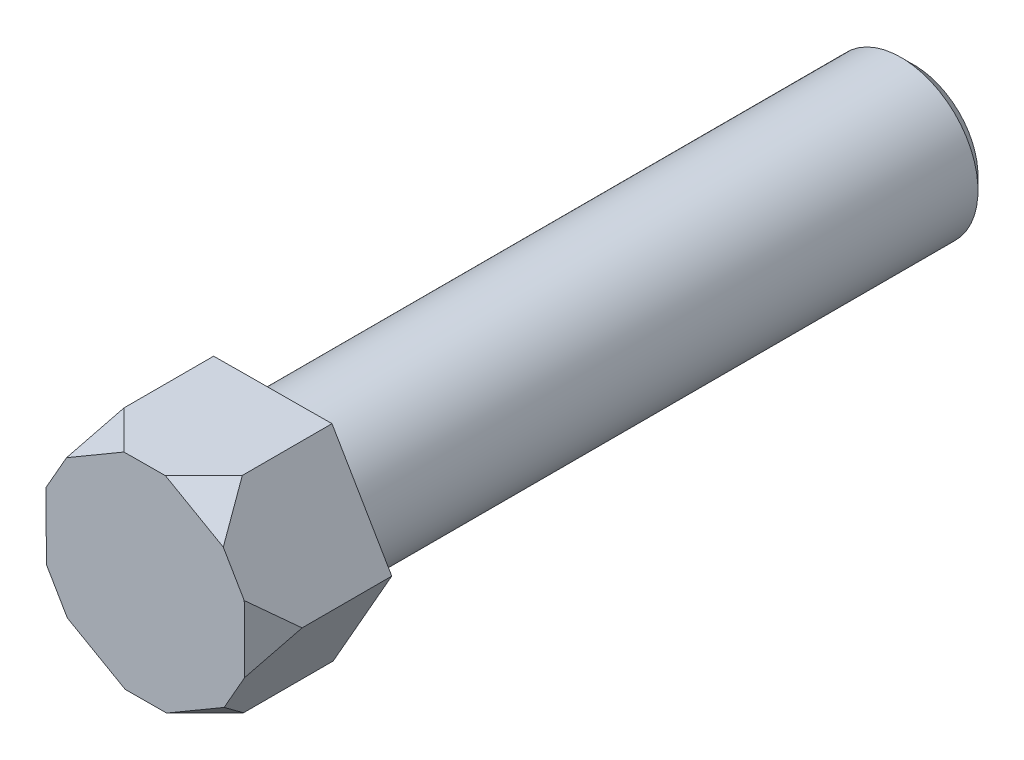
ISO-10303-21;
HEADER;
FILE_DESCRIPTION(('STEP AP214'),'2;1');
FILE_NAME('part.step','',(''),(''),'','','');
FILE_SCHEMA(('AUTOMOTIVE_DESIGN { 1 0 10303 214 1 1 1 1 }'));
ENDSEC;
DATA;
#1=APPLICATION_CONTEXT('core data for automotive mechanical design processes');
#2=APPLICATION_PROTOCOL_DEFINITION('international standard','automotive_design',2000,#1);
#3=PRODUCT_CONTEXT('',#1,'mechanical');
#4=PRODUCT('Part','Part','',(#3));
#5=PRODUCT_RELATED_PRODUCT_CATEGORY('part','',(#4));
#6=PRODUCT_DEFINITION_FORMATION('','',#4);
#7=PRODUCT_DEFINITION_CONTEXT('part definition',#1,'design');
#8=PRODUCT_DEFINITION('design','',#6,#7);
#9=PRODUCT_DEFINITION_SHAPE('','',#8);
#10=(LENGTH_UNIT() NAMED_UNIT(*) SI_UNIT(.MILLI.,.METRE.));
#11=(NAMED_UNIT(*) PLANE_ANGLE_UNIT() SI_UNIT($,.RADIAN.));
#12=(NAMED_UNIT(*) SI_UNIT($,.STERADIAN.) SOLID_ANGLE_UNIT());
#13=UNCERTAINTY_MEASURE_WITH_UNIT(LENGTH_MEASURE(1.E-05),#10,'distance_accuracy_value','');
#14=(GEOMETRIC_REPRESENTATION_CONTEXT(3) GLOBAL_UNCERTAINTY_ASSIGNED_CONTEXT((#13)) GLOBAL_UNIT_ASSIGNED_CONTEXT((#10,
#11,#12)) REPRESENTATION_CONTEXT('',''));
#15=CARTESIAN_POINT('',(0.,0.,0.));
#16=DIRECTION('',(0.,0.,1.));
#17=DIRECTION('',(1.,0.,0.));
#18=AXIS2_PLACEMENT_3D('',#15,#16,#17);
#19=CARTESIAN_POINT('',(-2.2857515646105,-4.01356115167241,-5.));
#20=DIRECTION('',(0.0059023212593593,-0.999982581150167,0.));
#21=DIRECTION('',(0.999982581150168,0.0059023212593593,0.));
#22=AXIS2_PLACEMENT_3D('',#19,#20,#21);
#23=PLANE('',#22);
#24=DIRECTION('',(0.999982581150168,0.0059023212593593,0.));
#25=VECTOR('',#24,1.);
#26=CARTESIAN_POINT('',(-2.2857515646105,-4.01356115167241,0.));
#27=LINE('',#26,#25);
#28=CARTESIAN_POINT('',(-0.785777692885251,-4.00470766978337,0.));
#29=VERTEX_POINT('',#28);
#30=CARTESIAN_POINT('',(0.832996262960126,-3.99515297941797,0.));
#31=VERTEX_POINT('',#30);
#32=EDGE_CURVE('E132',#29,#31,#27,.T.);
#33=ORIENTED_EDGE('',*,*,#32,.F.);
#34=DIRECTION('',(-0.70709446419971,-0.00417357138723445,-0.707106781186548));
#35=VECTOR('',#34,1.);
#36=CARTESIAN_POINT('',(-4.03572108162329,-4.02389021387629,-3.25));
#37=LINE('',#36,#35);
#38=CARTESIAN_POINT('',(-2.2857515646105,-4.01356115167241,-1.5));
#39=VERTEX_POINT('',#38);
#40=EDGE_CURVE('E120',#29,#39,#37,.T.);
#41=ORIENTED_EDGE('',*,*,#40,.T.);
#42=DIRECTION('',(0.,0.,1.));
#43=VECTOR('',#42,1.);
#44=CARTESIAN_POINT('',(-2.2857515646105,-4.01356115167241,-5.));
#45=LINE('',#44,#43);
#46=CARTESIAN_POINT('',(-2.2857515646105,-4.01356115167241,-5.));
#47=VERTEX_POINT('',#46);
#48=EDGE_CURVE('E155',#47,#39,#45,.T.);
#49=ORIENTED_EDGE('',*,*,#48,.F.);
#50=DIRECTION('',(0.999982581150168,0.0059023212593593,0.));
#51=VECTOR('',#50,1.);
#52=CARTESIAN_POINT('',(-2.2857515646105,-4.01356115167241,-5.));
#53=LINE('',#52,#51);
#54=CARTESIAN_POINT('',(2.33297013468538,-3.98629949752893,-5.));
#55=VERTEX_POINT('',#54);
#56=EDGE_CURVE('E274',#47,#55,#53,.T.);
#57=ORIENTED_EDGE('',*,*,#56,.T.);
#58=DIRECTION('',(0.,0.,1.));
#59=VECTOR('',#58,1.);
#60=CARTESIAN_POINT('',(2.33297013468538,-3.98629949752893,-5.));
#61=LINE('',#60,#59);
#62=CARTESIAN_POINT('',(2.33297013468538,-3.98629949752893,-1.5));
#63=VERTEX_POINT('',#62);
#64=EDGE_CURVE('E153',#55,#63,#61,.T.);
#65=ORIENTED_EDGE('',*,*,#64,.T.);
#66=DIRECTION('',(-0.707094464199711,-0.00417357138723448,0.707106781186547));
#67=VECTOR('',#66,1.);
#68=CARTESIAN_POINT('',(1.77357880205023,-3.98960126239679,-0.940598923241501));
#69=LINE('',#68,#67);
#70=EDGE_CURVE('E140',#63,#31,#69,.T.);
#71=ORIENTED_EDGE('',*,*,#70,.T.);
#72=EDGE_LOOP('',(#33,#41,#49,#57,#65,#71));
#73=FACE_BOUND('',#72,.T.);
#74=ADVANCED_FACE('F34',(#73),#23,.T.);
#75=CARTESIAN_POINT('',(0.,0.,0.));
#76=DIRECTION('',(0.,0.,1.));
#77=DIRECTION('',(1.,0.,0.));
#78=AXIS2_PLACEMENT_3D('',#75,#76,#77);
#79=PLANE('',#78);
#80=DIRECTION('',(0.505102850726986,-0.863059157988299,0.));
#81=VECTOR('',#80,1.);
#82=CARTESIAN_POINT('',(-4.61872169929589,-0.0272616541434812,0.));
#83=LINE('',#82,#81);
#84=CARTESIAN_POINT('',(-3.8610674232054,-1.32185039112593,0.));
#85=VERTEX_POINT('',#84);
#86=CARTESIAN_POINT('',(-3.04340584070098,-2.71897241468996,0.));
#87=VERTEX_POINT('',#86);
#88=EDGE_CURVE('E136',#85,#87,#83,.T.);
#89=ORIENTED_EDGE('',*,*,#88,.T.);
#90=DIRECTION('',(0.868961479247659,-0.494879730423181,0.));
#91=VECTOR('',#90,1.);
#92=CARTESIAN_POINT('',(-1.91459176679312,-3.36184004223666,0.));
#93=LINE('',#92,#91);
#94=EDGE_CURVE('E123',#87,#29,#93,.T.);
#95=ORIENTED_EDGE('',*,*,#94,.T.);
#96=ORIENTED_EDGE('',*,*,#32,.T.);
#97=DIRECTION('',(0.8630591579883,0.505102850726986,0.));
#98=VECTOR('',#97,1.);
#99=CARTESIAN_POINT('',(1.95414299664014,-3.33900512903771,0.));
#100=LINE('',#99,#98);
#101=CARTESIAN_POINT('',(3.07528973032015,-2.68285727865744,0.));
#102=VERTEX_POINT('',#101);
#103=EDGE_CURVE('E188',#31,#102,#100,.T.);
#104=ORIENTED_EDGE('',*,*,#103,.T.);
#105=DIRECTION('',(0.494879730423182,0.868961479247659,0.));
#106=VECTOR('',#105,1.);
#107=CARTESIAN_POINT('',(2.33297013468538,-3.98629949752893,0.));
#108=LINE('',#107,#106);
#109=CARTESIAN_POINT('',(3.87640210366112,-1.27618056472801,0.));
#110=VERTEX_POINT('',#109);
#111=EDGE_CURVE('E141',#102,#110,#108,.T.);
#112=ORIENTED_EDGE('',*,*,#111,.T.);
#113=DIRECTION('',(-0.00590232125935969,0.999982581150168,0.));
#114=VECTOR('',#113,1.);
#115=CARTESIAN_POINT('',(3.86873476343326,0.02283491319896,0.));
#116=LINE('',#115,#114);
#117=CARTESIAN_POINT('',(3.86106742320541,1.32185039112593,0.));
#118=VERTEX_POINT('',#117);
#119=EDGE_CURVE('E176',#110,#118,#116,.T.);
#120=ORIENTED_EDGE('',*,*,#119,.T.);
#121=DIRECTION('',(-0.505102850726986,0.863059157988299,0.));
#122=VECTOR('',#121,1.);
#123=CARTESIAN_POINT('',(4.61872169929589,0.0272616541434816,0.));
#124=LINE('',#123,#122);
#125=CARTESIAN_POINT('',(3.04340584070099,2.71897241468996,0.));
#126=VERTEX_POINT('',#125);
#127=EDGE_CURVE('E251',#118,#126,#124,.T.);
#128=ORIENTED_EDGE('',*,*,#127,.T.);
#129=DIRECTION('',(-0.868961479247659,0.494879730423181,0.));
#130=VECTOR('',#129,1.);
#131=CARTESIAN_POINT('',(1.91459176679312,3.36184004223666,0.));
#132=LINE('',#131,#130);
#133=CARTESIAN_POINT('',(0.78577769288525,4.00470766978337,0.));
#134=VERTEX_POINT('',#133);
#135=EDGE_CURVE('E173',#126,#134,#132,.T.);
#136=ORIENTED_EDGE('',*,*,#135,.T.);
#137=DIRECTION('',(-0.999982581150168,-0.00590232125935966,0.));
#138=VECTOR('',#137,1.);
#139=CARTESIAN_POINT('',(2.2857515646105,4.01356115167241,0.));
#140=LINE('',#139,#138);
#141=CARTESIAN_POINT('',(-0.832996262960132,3.99515297941797,0.));
#142=VERTEX_POINT('',#141);
#143=EDGE_CURVE('E253',#134,#142,#140,.T.);
#144=ORIENTED_EDGE('',*,*,#143,.T.);
#145=DIRECTION('',(-0.863059157988299,-0.505102850726986,0.));
#146=VECTOR('',#145,1.);
#147=CARTESIAN_POINT('',(-1.95414299664014,3.3390051290377,0.));
#148=LINE('',#147,#146);
#149=CARTESIAN_POINT('',(-3.07528973032015,2.68285727865744,0.));
#150=VERTEX_POINT('',#149);
#151=EDGE_CURVE('E191',#142,#150,#148,.T.);
#152=ORIENTED_EDGE('',*,*,#151,.T.);
#153=DIRECTION('',(-0.494879730423181,-0.868961479247659,0.));
#154=VECTOR('',#153,1.);
#155=CARTESIAN_POINT('',(-2.33297013468538,3.98629949752893,0.));
#156=LINE('',#155,#154);
#157=CARTESIAN_POINT('',(-3.87640210366111,1.27618056472801,0.));
#158=VERTEX_POINT('',#157);
#159=EDGE_CURVE('E145',#150,#158,#156,.T.);
#160=ORIENTED_EDGE('',*,*,#159,.T.);
#161=DIRECTION('',(0.00590232125936021,-0.999982581150167,0.));
#162=VECTOR('',#161,1.);
#163=CARTESIAN_POINT('',(-3.86873476343326,-0.022834913198962,0.));
#164=LINE('',#163,#162);
#165=EDGE_CURVE('E201',#158,#85,#164,.T.);
#166=ORIENTED_EDGE('',*,*,#165,.T.);
#167=EDGE_LOOP('',(#89,#95,#96,#104,#112,#120,#128,#136,#144,#152,#160,#166));
#168=FACE_BOUND('',#167,.T.);
#169=ADVANCED_FACE('F130',(#168),#79,.T.);
#170=CARTESIAN_POINT('',(-4.61872169929589,-0.0272616541434812,-5.));
#171=DIRECTION('',(-0.863059157988299,-0.505102850726987,0.));
#172=DIRECTION('',(0.505102850726987,-0.863059157988299,0.));
#173=AXIS2_PLACEMENT_3D('',#170,#171,#172);
#174=PLANE('',#173);
#175=ORIENTED_EDGE('',*,*,#48,.T.);
#176=DIRECTION('',(-0.357161650945709,0.610274983178678,0.707106781186548));
#177=VECTOR('',#176,1.);
#178=CARTESIAN_POINT('',(-2.56830664318097,-3.53076492938747,-0.940598923241498));
#179=LINE('',#178,#177);
#180=EDGE_CURVE('E49',#39,#87,#179,.T.);
#181=ORIENTED_EDGE('',*,*,#180,.T.);
#182=ORIENTED_EDGE('',*,*,#88,.F.);
#183=DIRECTION('',(-0.357161650945709,0.610274983178678,-0.707106781186548));
#184=VECTOR('',#183,1.);
#185=CARTESIAN_POINT('',(-5.50265168806811,1.48309187233604,-3.25));
#186=LINE('',#185,#184);
#187=CARTESIAN_POINT('',(-4.61872169929589,-0.0272616541434812,-1.5));
#188=VERTEX_POINT('',#187);
#189=EDGE_CURVE('E203',#85,#188,#186,.T.);
#190=ORIENTED_EDGE('',*,*,#189,.T.);
#191=DIRECTION('',(0.,0.,1.));
#192=VECTOR('',#191,1.);
#193=CARTESIAN_POINT('',(-4.61872169929589,-0.0272616541434812,-5.));
#194=LINE('',#193,#192);
#195=CARTESIAN_POINT('',(-4.61872169929589,-0.0272616541434812,-5.));
#196=VERTEX_POINT('',#195);
#197=EDGE_CURVE('E157',#196,#188,#194,.T.);
#198=ORIENTED_EDGE('',*,*,#197,.F.);
#199=DIRECTION('',(0.505102850726986,-0.863059157988299,0.));
#200=VECTOR('',#199,1.);
#201=CARTESIAN_POINT('',(-4.61872169929589,-0.0272616541434812,-5.));
#202=LINE('',#201,#200);
#203=EDGE_CURVE('E266',#196,#47,#202,.T.);
#204=ORIENTED_EDGE('',*,*,#203,.T.);
#205=EDGE_LOOP('',(#175,#181,#182,#190,#198,#204));
#206=FACE_BOUND('',#205,.T.);
#207=ADVANCED_FACE('F223',(#206),#174,.T.);
#208=CARTESIAN_POINT('',(-2.33297013468538,3.98629949752893,-5.));
#209=DIRECTION('',(-0.868961479247659,0.494879730423181,0.));
#210=DIRECTION('',(-0.494879730423181,-0.868961479247659,0.));
#211=AXIS2_PLACEMENT_3D('',#208,#209,#210);
#212=PLANE('',#211);
#213=ORIENTED_EDGE('',*,*,#197,.T.);
#214=DIRECTION('',(0.349932813254002,0.614448554565913,0.707106781186548));
#215=VECTOR('',#214,1.);
#216=CARTESIAN_POINT('',(-4.3418854452312,0.45883633300932,-0.9405989232415));
#217=LINE('',#216,#215);
#218=EDGE_CURVE('E57',#188,#158,#217,.T.);
#219=ORIENTED_EDGE('',*,*,#218,.T.);
#220=ORIENTED_EDGE('',*,*,#159,.F.);
#221=DIRECTION('',(0.349932813254002,0.614448554565913,-0.707106781186547));
#222=VECTOR('',#221,1.);
#223=CARTESIAN_POINT('',(-1.46693060644482,5.50698208621233,-3.25));
#224=LINE('',#223,#222);
#225=CARTESIAN_POINT('',(-2.33297013468538,3.98629949752893,-1.5));
#226=VERTEX_POINT('',#225);
#227=EDGE_CURVE('E197',#150,#226,#224,.T.);
#228=ORIENTED_EDGE('',*,*,#227,.T.);
#229=DIRECTION('',(0.,0.,1.));
#230=VECTOR('',#229,1.);
#231=CARTESIAN_POINT('',(-2.33297013468538,3.98629949752893,-5.));
#232=LINE('',#231,#230);
#233=CARTESIAN_POINT('',(-2.33297013468538,3.98629949752893,-5.));
#234=VERTEX_POINT('',#233);
#235=EDGE_CURVE('E160',#234,#226,#232,.T.);
#236=ORIENTED_EDGE('',*,*,#235,.F.);
#237=DIRECTION('',(-0.494879730423181,-0.868961479247659,0.));
#238=VECTOR('',#237,1.);
#239=CARTESIAN_POINT('',(-2.33297013468538,3.98629949752893,-5.));
#240=LINE('',#239,#238);
#241=EDGE_CURVE('E263',#234,#196,#240,.T.);
#242=ORIENTED_EDGE('',*,*,#241,.T.);
#243=EDGE_LOOP('',(#213,#219,#220,#228,#236,#242));
#244=FACE_BOUND('',#243,.T.);
#245=ADVANCED_FACE('F230',(#244),#212,.T.);
#246=CARTESIAN_POINT('',(2.2857515646105,4.01356115167241,-5.));
#247=DIRECTION('',(-0.00590232125935966,0.999982581150167,0.));
#248=DIRECTION('',(-0.999982581150168,-0.00590232125935967,0.));
#249=AXIS2_PLACEMENT_3D('',#246,#247,#248);
#250=PLANE('',#249);
#251=ORIENTED_EDGE('',*,*,#235,.T.);
#252=DIRECTION('',(0.707094464199711,0.00417357138723478,0.707106781186547));
#253=VECTOR('',#252,1.);
#254=CARTESIAN_POINT('',(-1.77357880205023,3.98960126239679,-0.940598923241497));
#255=LINE('',#254,#253);
#256=EDGE_CURVE('E194',#226,#142,#255,.T.);
#257=ORIENTED_EDGE('',*,*,#256,.T.);
#258=ORIENTED_EDGE('',*,*,#143,.F.);
#259=DIRECTION('',(0.707094464199711,0.00417357138723471,-0.707106781186547));
#260=VECTOR('',#259,1.);
#261=CARTESIAN_POINT('',(4.0357210816233,4.02389021387629,-3.25));
#262=LINE('',#261,#260);
#263=CARTESIAN_POINT('',(2.2857515646105,4.01356115167241,-1.5));
#264=VERTEX_POINT('',#263);
#265=EDGE_CURVE('E170',#134,#264,#262,.T.);
#266=ORIENTED_EDGE('',*,*,#265,.T.);
#267=DIRECTION('',(0.,0.,1.));
#268=VECTOR('',#267,1.);
#269=CARTESIAN_POINT('',(2.2857515646105,4.01356115167241,-5.));
#270=LINE('',#269,#268);
#271=CARTESIAN_POINT('',(2.2857515646105,4.01356115167241,-5.));
#272=VERTEX_POINT('',#271);
#273=EDGE_CURVE('E163',#272,#264,#270,.T.);
#274=ORIENTED_EDGE('',*,*,#273,.F.);
#275=DIRECTION('',(-0.999982581150168,-0.00590232125935966,0.));
#276=VECTOR('',#275,1.);
#277=CARTESIAN_POINT('',(2.2857515646105,4.01356115167241,-5.));
#278=LINE('',#277,#276);
#279=EDGE_CURVE('E276',#272,#234,#278,.T.);
#280=ORIENTED_EDGE('',*,*,#279,.T.);
#281=EDGE_LOOP('',(#251,#257,#258,#266,#274,#280));
#282=FACE_BOUND('',#281,.T.);
#283=ADVANCED_FACE('F234',(#282),#250,.T.);
#284=CARTESIAN_POINT('',(2.33297013468538,-3.98629949752893,-5.));
#285=DIRECTION('',(0.868961479247659,-0.494879730423182,0.));
#286=DIRECTION('',(0.494879730423182,0.868961479247659,0.));
#287=AXIS2_PLACEMENT_3D('',#284,#285,#286);
#288=PLANE('',#287);
#289=ORIENTED_EDGE('',*,*,#111,.F.);
#290=DIRECTION('',(-0.349932813254002,-0.614448554565913,-0.707106781186547));
#291=VECTOR('',#290,1.);
#292=CARTESIAN_POINT('',(1.46693060644481,-5.50698208621233,-3.25));
#293=LINE('',#292,#291);
#294=EDGE_CURVE('E185',#102,#63,#293,.T.);
#295=ORIENTED_EDGE('',*,*,#294,.T.);
#296=ORIENTED_EDGE('',*,*,#64,.F.);
#297=DIRECTION('',(0.494879730423182,0.868961479247659,0.));
#298=VECTOR('',#297,1.);
#299=CARTESIAN_POINT('',(2.33297013468538,-3.98629949752893,-5.));
#300=LINE('',#299,#298);
#301=CARTESIAN_POINT('',(4.61872169929589,0.0272616541434816,-5.));
#302=VERTEX_POINT('',#301);
#303=EDGE_CURVE('E166',#55,#302,#300,.T.);
#304=ORIENTED_EDGE('',*,*,#303,.T.);
#305=DIRECTION('',(0.,0.,1.));
#306=VECTOR('',#305,1.);
#307=CARTESIAN_POINT('',(4.61872169929589,0.0272616541434816,-5.));
#308=LINE('',#307,#306);
#309=CARTESIAN_POINT('',(4.61872169929589,0.0272616541434806,-1.5));
#310=VERTEX_POINT('',#309);
#311=EDGE_CURVE('E149',#302,#310,#308,.T.);
#312=ORIENTED_EDGE('',*,*,#311,.T.);
#313=DIRECTION('',(-0.349932813254002,-0.614448554565913,0.707106781186548));
#314=VECTOR('',#313,1.);
#315=CARTESIAN_POINT('',(4.3418854452312,-0.458836333009322,-0.940598923241495));
#316=LINE('',#315,#314);
#317=EDGE_CURVE('E182',#310,#110,#316,.T.);
#318=ORIENTED_EDGE('',*,*,#317,.T.);
#319=EDGE_LOOP('',(#289,#295,#296,#304,#312,#318));
#320=FACE_BOUND('',#319,.T.);
#321=ADVANCED_FACE('F227',(#320),#288,.T.);
#322=CARTESIAN_POINT('',(4.61872169929589,0.0272616541434816,-5.));
#323=DIRECTION('',(0.863059157988299,0.505102850726986,0.));
#324=DIRECTION('',(-0.505102850726986,0.863059157988299,0.));
#325=AXIS2_PLACEMENT_3D('',#322,#323,#324);
#326=PLANE('',#325);
#327=ORIENTED_EDGE('',*,*,#127,.F.);
#328=DIRECTION('',(0.357161650945708,-0.610274983178678,-0.707106781186548));
#329=VECTOR('',#328,1.);
#330=CARTESIAN_POINT('',(5.50265168806811,-1.48309187233604,-3.25));
#331=LINE('',#330,#329);
#332=EDGE_CURVE('E179',#118,#310,#331,.T.);
#333=ORIENTED_EDGE('',*,*,#332,.T.);
#334=ORIENTED_EDGE('',*,*,#311,.F.);
#335=DIRECTION('',(-0.505102850726986,0.863059157988299,0.));
#336=VECTOR('',#335,1.);
#337=CARTESIAN_POINT('',(4.61872169929589,0.0272616541434816,-5.));
#338=LINE('',#337,#336);
#339=EDGE_CURVE('E143',#302,#272,#338,.T.);
#340=ORIENTED_EDGE('',*,*,#339,.T.);
#341=ORIENTED_EDGE('',*,*,#273,.T.);
#342=DIRECTION('',(0.357161650945709,-0.610274983178678,0.707106781186548));
#343=VECTOR('',#342,1.);
#344=CARTESIAN_POINT('',(2.56830664318097,3.53076492938747,-0.940598923241499));
#345=LINE('',#344,#343);
#346=EDGE_CURVE('E167',#264,#126,#345,.T.);
#347=ORIENTED_EDGE('',*,*,#346,.T.);
#348=EDGE_LOOP('',(#327,#333,#334,#340,#341,#347));
#349=FACE_BOUND('',#348,.T.);
#350=ADVANCED_FACE('F238',(#349),#326,.T.);
#351=CARTESIAN_POINT('',(0.,0.,-5.));
#352=DIRECTION('',(0.,0.,1.));
#353=DIRECTION('',(1.,0.,0.));
#354=AXIS2_PLACEMENT_3D('',#351,#352,#353);
#355=PLANE('',#354);
#356=CARTESIAN_POINT('',(0.,0.,-5.));
#357=DIRECTION('',(0.,0.,-1.));
#358=DIRECTION('',(-1.,0.,0.));
#359=AXIS2_PLACEMENT_3D('',#356,#357,#358);
#360=CIRCLE('',#359,3.);
#361=CARTESIAN_POINT('',(-3.,0.,-5.));
#362=VERTEX_POINT('',#361);
#363=EDGE_CURVE('E152',#362,#362,#360,.T.);
#364=ORIENTED_EDGE('',*,*,#363,.F.);
#365=EDGE_LOOP('',(#364));
#366=FACE_BOUND('',#365,.T.);
#367=ORIENTED_EDGE('',*,*,#339,.F.);
#368=ORIENTED_EDGE('',*,*,#303,.F.);
#369=ORIENTED_EDGE('',*,*,#56,.F.);
#370=ORIENTED_EDGE('',*,*,#203,.F.);
#371=ORIENTED_EDGE('',*,*,#241,.F.);
#372=ORIENTED_EDGE('',*,*,#279,.F.);
#373=EDGE_LOOP('',(#367,#368,#369,#370,#371,#372));
#374=FACE_BOUND('',#373,.T.);
#375=ADVANCED_FACE('F240',(#366,#374),#355,.F.);
#376=CARTESIAN_POINT('',(0.,0.,-30.));
#377=DIRECTION('',(0.,0.,1.));
#378=DIRECTION('',(1.,0.,0.));
#379=AXIS2_PLACEMENT_3D('',#376,#377,#378);
#380=CYLINDRICAL_SURFACE('',#379,3.);
#381=CARTESIAN_POINT('',(0.,0.,-29.5));
#382=DIRECTION('',(0.,0.,-1.));
#383=DIRECTION('',(-1.,0.,0.));
#384=AXIS2_PLACEMENT_3D('',#381,#382,#383);
#385=CIRCLE('',#384,3.);
#386=CARTESIAN_POINT('',(-3.,0.,-29.5));
#387=VERTEX_POINT('',#386);
#388=EDGE_CURVE('E11',#387,#387,#385,.F.);
#389=ORIENTED_EDGE('',*,*,#388,.T.);
#390=EDGE_LOOP('',(#389));
#391=FACE_BOUND('',#390,.T.);
#392=ORIENTED_EDGE('',*,*,#363,.T.);
#393=EDGE_LOOP('',(#392));
#394=FACE_BOUND('',#393,.T.);
#395=ADVANCED_FACE('F246',(#391,#394),#380,.T.);
#396=CARTESIAN_POINT('',(0.,0.,-30.));
#397=DIRECTION('',(0.,0.,-1.));
#398=DIRECTION('',(-1.,0.,0.));
#399=AXIS2_PLACEMENT_3D('',#396,#397,#398);
#400=PLANE('',#399);
#401=CARTESIAN_POINT('',(0.,0.,-30.));
#402=DIRECTION('',(0.,0.,-1.));
#403=DIRECTION('',(-1.,0.,0.));
#404=AXIS2_PLACEMENT_3D('',#401,#402,#403);
#405=CIRCLE('',#404,2.49999999999999);
#406=CARTESIAN_POINT('',(-2.49999999999999,0.,-30.));
#407=VERTEX_POINT('',#406);
#408=EDGE_CURVE('E42',#407,#407,#405,.T.);
#409=ORIENTED_EDGE('',*,*,#408,.T.);
#410=EDGE_LOOP('',(#409));
#411=FACE_BOUND('',#410,.T.);
#412=ADVANCED_FACE('F208',(#411),#400,.T.);
#413=CARTESIAN_POINT('',(1.53167341343449,2.68947203378933,1.5475208614068));
#414=DIRECTION('',(0.442633887165201,0.777222774970615,0.447213595499958));
#415=DIRECTION('',(0.,-0.498731331840162,0.866756631725964));
#416=AXIS2_PLACEMENT_3D('',#413,#414,#415);
#417=PLANE('',#416);
#418=ORIENTED_EDGE('',*,*,#346,.F.);
#419=ORIENTED_EDGE('',*,*,#265,.F.);
#420=ORIENTED_EDGE('',*,*,#135,.F.);
#421=EDGE_LOOP('',(#418,#419,#420));
#422=FACE_BOUND('',#421,.T.);
#423=ADVANCED_FACE('F291',(#422),#417,.T.);
#424=CARTESIAN_POINT('',(3.09498781074661,0.018267930559168,1.5475208614068));
#425=DIRECTION('',(0.89441161110699,0.00527919662438817,0.447213595499958));
#426=DIRECTION('',(0.447219827533117,0.,-0.894424074956197));
#427=AXIS2_PLACEMENT_3D('',#424,#425,#426);
#428=PLANE('',#427);
#429=ORIENTED_EDGE('',*,*,#119,.F.);
#430=ORIENTED_EDGE('',*,*,#317,.F.);
#431=ORIENTED_EDGE('',*,*,#332,.F.);
#432=EDGE_LOOP('',(#429,#430,#431));
#433=FACE_BOUND('',#432,.T.);
#434=ADVANCED_FACE('F296',(#433),#428,.T.);
#435=CARTESIAN_POINT('',(1.56331439731211,-2.67120410323016,1.5475208614068));
#436=DIRECTION('',(0.451777723941788,-0.771943578346227,0.447213595499958));
#437=DIRECTION('',(0.8630591579883,0.505102850726986,0.));
#438=AXIS2_PLACEMENT_3D('',#435,#436,#437);
#439=PLANE('',#438);
#440=ORIENTED_EDGE('',*,*,#294,.F.);
#441=ORIENTED_EDGE('',*,*,#103,.F.);
#442=ORIENTED_EDGE('',*,*,#70,.F.);
#443=EDGE_LOOP('',(#440,#441,#442));
#444=FACE_BOUND('',#443,.T.);
#445=ADVANCED_FACE('F300',(#444),#439,.T.);
#446=CARTESIAN_POINT('',(-1.56331439731211,2.67120410323016,1.5475208614068));
#447=DIRECTION('',(-0.451777723941788,0.771943578346227,0.447213595499958));
#448=DIRECTION('',(-0.863059157988299,-0.505102850726986,0.));
#449=AXIS2_PLACEMENT_3D('',#446,#447,#448);
#450=PLANE('',#449);
#451=ORIENTED_EDGE('',*,*,#151,.F.);
#452=ORIENTED_EDGE('',*,*,#256,.F.);
#453=ORIENTED_EDGE('',*,*,#227,.F.);
#454=EDGE_LOOP('',(#451,#452,#453));
#455=FACE_BOUND('',#454,.T.);
#456=ADVANCED_FACE('F304',(#455),#450,.T.);
#457=CARTESIAN_POINT('',(-3.09498781074661,-0.0182679305591696,1.5475208614068));
#458=DIRECTION('',(-0.89441161110699,-0.00527919662438864,0.447213595499958));
#459=DIRECTION('',(0.447219827533116,0.,0.894424074956197));
#460=AXIS2_PLACEMENT_3D('',#457,#458,#459);
#461=PLANE('',#460);
#462=ORIENTED_EDGE('',*,*,#218,.F.);
#463=ORIENTED_EDGE('',*,*,#189,.F.);
#464=ORIENTED_EDGE('',*,*,#165,.F.);
#465=EDGE_LOOP('',(#462,#463,#464));
#466=FACE_BOUND('',#465,.T.);
#467=ADVANCED_FACE('F215',(#466),#461,.T.);
#468=CARTESIAN_POINT('',(-1.5316734134345,-2.68947203378933,1.5475208614068));
#469=DIRECTION('',(-0.442633887165202,-0.777222774970615,0.447213595499958));
#470=DIRECTION('',(0.,-0.498731331840161,-0.866756631725964));
#471=AXIS2_PLACEMENT_3D('',#468,#469,#470);
#472=PLANE('',#471);
#473=ORIENTED_EDGE('',*,*,#180,.F.);
#474=ORIENTED_EDGE('',*,*,#40,.F.);
#475=ORIENTED_EDGE('',*,*,#94,.F.);
#476=EDGE_LOOP('',(#473,#474,#475));
#477=FACE_BOUND('',#476,.T.);
#478=ADVANCED_FACE('F122',(#477),#472,.T.);
#479=CARTESIAN_POINT('',(0.,0.,-30.));
#480=DIRECTION('',(0.,0.,1.));
#481=DIRECTION('',(1.,0.,0.));
#482=AXIS2_PLACEMENT_3D('',#479,#480,#481);
#483=CONICAL_SURFACE('',#482,2.49999999999999,0.78539816339746);
#484=ORIENTED_EDGE('',*,*,#388,.F.);
#485=EDGE_LOOP('',(#484));
#486=FACE_BOUND('',#485,.T.);
#487=ORIENTED_EDGE('',*,*,#408,.F.);
#488=EDGE_LOOP('',(#487));
#489=FACE_BOUND('',#488,.T.);
#490=ADVANCED_FACE('F36',(#486,#489),#483,.T.);
#491=CLOSED_SHELL('',(#74,#169,#207,#245,#283,#321,#350,#375,#395,#412,#423,#434,#445,#456,#467,
#478,#490));
#492=MANIFOLD_SOLID_BREP('B2',#491);
#493=ADVANCED_BREP_SHAPE_REPRESENTATION('',(#18,#492),#14);
#494=SHAPE_DEFINITION_REPRESENTATION(#9,#493);
ENDSEC;
END-ISO-10303-21;
